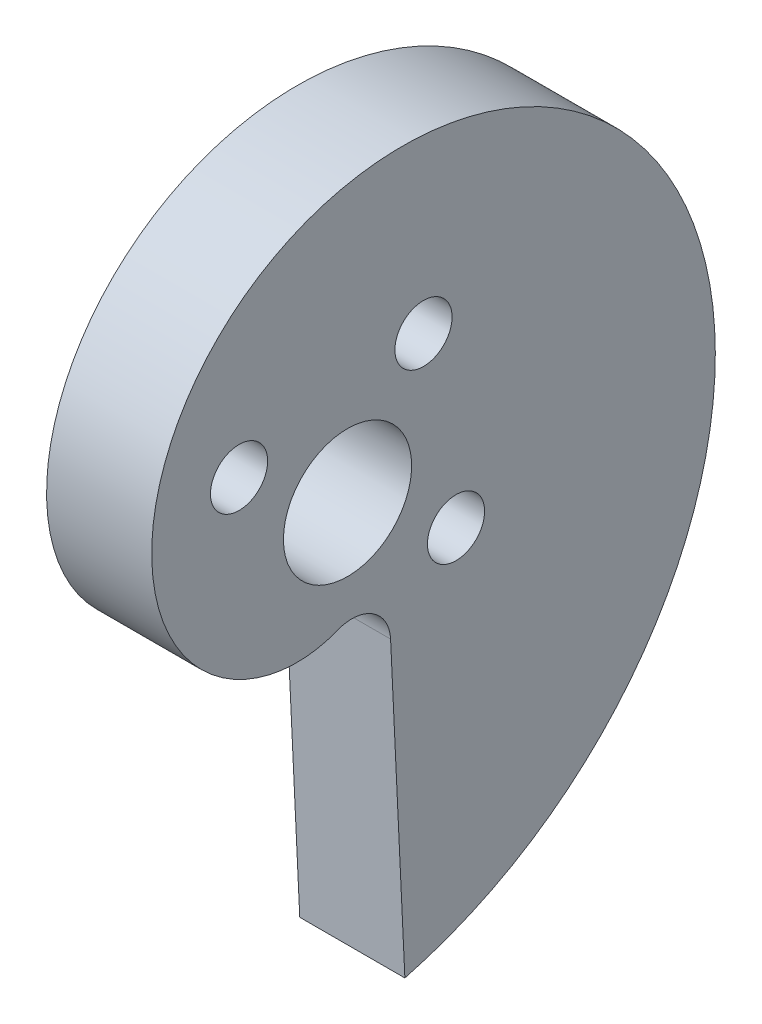
ISO-10303-21;
HEADER;
FILE_DESCRIPTION(('STEP AP214'),'2;1');
FILE_NAME('part.step','',(''),(''),'','','');
FILE_SCHEMA(('AUTOMOTIVE_DESIGN { 1 0 10303 214 1 1 1 1 }'));
ENDSEC;
DATA;
#1=APPLICATION_CONTEXT('core data for automotive mechanical design processes');
#2=APPLICATION_PROTOCOL_DEFINITION('international standard','automotive_design',2000,#1);
#3=PRODUCT_CONTEXT('',#1,'mechanical');
#4=PRODUCT('Part','Part','',(#3));
#5=PRODUCT_RELATED_PRODUCT_CATEGORY('part','',(#4));
#6=PRODUCT_DEFINITION_FORMATION('','',#4);
#7=PRODUCT_DEFINITION_CONTEXT('part definition',#1,'design');
#8=PRODUCT_DEFINITION('design','',#6,#7);
#9=PRODUCT_DEFINITION_SHAPE('','',#8);
#10=(LENGTH_UNIT() NAMED_UNIT(*) SI_UNIT(.MILLI.,.METRE.));
#11=(NAMED_UNIT(*) PLANE_ANGLE_UNIT() SI_UNIT($,.RADIAN.));
#12=(NAMED_UNIT(*) SI_UNIT($,.STERADIAN.) SOLID_ANGLE_UNIT());
#13=UNCERTAINTY_MEASURE_WITH_UNIT(LENGTH_MEASURE(1.E-05),#10,'distance_accuracy_value','');
#14=(GEOMETRIC_REPRESENTATION_CONTEXT(3) GLOBAL_UNCERTAINTY_ASSIGNED_CONTEXT((#13)) GLOBAL_UNIT_ASSIGNED_CONTEXT((#10,
#11,#12)) REPRESENTATION_CONTEXT('',''));
#15=CARTESIAN_POINT('',(0.,0.,0.));
#16=DIRECTION('',(0.,0.,1.));
#17=DIRECTION('',(1.,0.,0.));
#18=AXIS2_PLACEMENT_3D('',#15,#16,#17);
#19=CARTESIAN_POINT('',(6.35,16.3980040897592,0.208936694079273));
#20=DIRECTION('',(1.,0.,0.));
#21=DIRECTION('',(0.,0.,-1.));
#22=AXIS2_PLACEMENT_3D('',#19,#20,#21);
#23=PLANE('',#22);
#24=CARTESIAN_POINT('',(6.35,0.,0.));
#25=DIRECTION('',(-1.,0.,0.));
#26=DIRECTION('',(0.,0.,1.));
#27=AXIS2_PLACEMENT_3D('',#24,#25,#26);
#28=CIRCLE('',#27,3.873);
#29=CARTESIAN_POINT('',(6.35,0.,3.873));
#30=VERTEX_POINT('',#29);
#31=EDGE_CURVE('E138',#30,#30,#28,.T.);
#32=ORIENTED_EDGE('',*,*,#31,.T.);
#33=EDGE_LOOP('',(#32));
#34=FACE_BOUND('',#33,.T.);
#35=CARTESIAN_POINT('',(6.35,4.58861149080839,6.55321635431194));
#36=DIRECTION('',(-1.,0.,0.));
#37=DIRECTION('',(0.,0.,1.));
#38=AXIS2_PLACEMENT_3D('',#35,#36,#37);
#39=CIRCLE('',#38,1.7272);
#40=CARTESIAN_POINT('',(6.35,4.58861149080839,8.28041635431194));
#41=VERTEX_POINT('',#40);
#42=EDGE_CURVE('E142',#41,#41,#39,.T.);
#43=ORIENTED_EDGE('',*,*,#42,.T.);
#44=EDGE_LOOP('',(#43));
#45=FACE_BOUND('',#44,.T.);
#46=CARTESIAN_POINT('',(6.35,6.55321635431194,-4.58861149080837));
#47=DIRECTION('',(-1.,0.,0.));
#48=DIRECTION('',(0.,0.,1.));
#49=AXIS2_PLACEMENT_3D('',#46,#47,#48);
#50=CIRCLE('',#49,1.7272);
#51=CARTESIAN_POINT('',(6.35,6.55321635431194,-2.86141149080837));
#52=VERTEX_POINT('',#51);
#53=EDGE_CURVE('E146',#52,#52,#50,.T.);
#54=ORIENTED_EDGE('',*,*,#53,.T.);
#55=EDGE_LOOP('',(#54));
#56=FACE_BOUND('',#55,.T.);
#57=CARTESIAN_POINT('',(6.35,-4.58861149080837,-6.55321635431192));
#58=DIRECTION('',(-1.,0.,0.));
#59=DIRECTION('',(0.,0.,1.));
#60=AXIS2_PLACEMENT_3D('',#57,#58,#59);
#61=CIRCLE('',#60,1.7272);
#62=CARTESIAN_POINT('',(6.35,-4.58861149080837,-4.82601635431192));
#63=VERTEX_POINT('',#62);
#64=EDGE_CURVE('E87',#63,#63,#61,.T.);
#65=ORIENTED_EDGE('',*,*,#64,.T.);
#66=EDGE_LOOP('',(#65));
#67=FACE_BOUND('',#66,.T.);
#68=CARTESIAN_POINT('',(6.35,-26.6041786448891,-3.46411616806894));
#69=CARTESIAN_POINT('',(6.35,-26.5960990181453,-3.49393067135354));
#70=CARTESIAN_POINT('',(6.35,-26.5880156349324,-3.52374410868873));
#71=CARTESIAN_POINT('',(6.35,-26.5718488325451,-3.58337111594988));
#72=CARTESIAN_POINT('',(6.35,-26.5637654133707,-3.61318468587584));
#73=CARTESIAN_POINT('',(6.35,-26.5395261439436,-3.70262963202641));
#74=CARTESIAN_POINT('',(6.35,-26.5233815637382,-3.76226420628094));
#75=CARTESIAN_POINT('',(6.35,-26.4906236526863,-3.88140637873935));
#76=CARTESIAN_POINT('',(6.35,-26.4740103112024,-3.94091397402874));
#77=CARTESIAN_POINT('',(6.35,-26.4403815894244,-4.05981460436438));
#78=CARTESIAN_POINT('',(6.35,-26.4233662121929,-4.11920764027957));
#79=CARTESIAN_POINT('',(6.35,-26.3716923994657,-4.29720938115184));
#80=CARTESIAN_POINT('',(6.35,-26.3364072843143,-4.41563707917067));
#81=CARTESIAN_POINT('',(6.35,-26.2641853845529,-4.6519850599258));
#82=CARTESIAN_POINT('',(6.35,-26.2272486119225,-4.76990534633561));
#83=CARTESIAN_POINT('',(6.35,-26.1139444068046,-5.12293103285834));
#84=CARTESIAN_POINT('',(6.35,-26.0350986002427,-5.35724781947172));
#85=CARTESIAN_POINT('',(6.35,-25.8708563849999,-5.8235592949556));
#86=CARTESIAN_POINT('',(6.35,-25.7854600420231,-6.05555400709093));
#87=CARTESIAN_POINT('',(6.35,-25.5195003139906,-6.74780898379338));
#88=CARTESIAN_POINT('',(6.35,-25.3291595386374,-7.20436094526831));
#89=CARTESIAN_POINT('',(6.35,-24.9225212871115,-8.10647878886224));
#90=CARTESIAN_POINT('',(6.35,-24.7061887301483,-8.55202882213988));
#91=CARTESIAN_POINT('',(6.35,-24.2482870811777,-9.42992884621023));
#92=CARTESIAN_POINT('',(6.35,-24.0067199993427,-9.86227988488946));
#93=CARTESIAN_POINT('',(6.35,-23.499035484093,-10.7123263424163));
#94=CARTESIAN_POINT('',(6.35,-23.2329186005125,-11.1300220892049));
#95=CARTESIAN_POINT('',(6.35,-22.7456402479494,-11.847851602567));
#96=CARTESIAN_POINT('',(6.35,-22.5296437628228,-12.1515056315926));
#97=CARTESIAN_POINT('',(6.35,-22.084413352748,-12.7489932481006));
#98=CARTESIAN_POINT('',(6.35,-21.8551785466971,-13.0428261798607));
#99=CARTESIAN_POINT('',(6.35,-21.3838895241104,-13.620035602395));
#100=CARTESIAN_POINT('',(6.35,-21.141834989919,-13.9034118337705));
#101=CARTESIAN_POINT('',(6.35,-20.6453436861472,-14.4590921821359));
#102=CARTESIAN_POINT('',(6.35,-20.3909071208197,-14.7313964816312));
#103=CARTESIAN_POINT('',(6.35,-19.870311136869,-15.2640889646824));
#104=CARTESIAN_POINT('',(6.35,-19.6041625900917,-15.5244877601765));
#105=CARTESIAN_POINT('',(6.35,-19.0603866610495,-16.0329689554833));
#106=CARTESIAN_POINT('',(6.35,-18.7827592318886,-16.2810513049693));
#107=CARTESIAN_POINT('',(6.35,-17.933432481453,-17.0059312611249));
#108=CARTESIAN_POINT('',(6.35,-17.3451183982972,-17.4635361757599));
#109=CARTESIAN_POINT('',(6.35,-16.1647015449857,-18.2976613403723));
#110=CARTESIAN_POINT('',(6.35,-15.5748340735074,-18.6773591195821));
#111=CARTESIAN_POINT('',(6.35,-14.3640301688315,-19.3835613476243));
#112=CARTESIAN_POINT('',(6.35,-13.7430946848625,-19.7100674203402));
#113=CARTESIAN_POINT('',(6.35,-12.4747331278291,-20.3069368781326));
#114=CARTESIAN_POINT('',(6.35,-11.8273052792346,-20.5772964928467));
#115=CARTESIAN_POINT('',(6.35,-10.5107649849682,-21.0586719994844));
#116=CARTESIAN_POINT('',(6.35,-9.84165333182641,-21.2696900575841));
#117=CARTESIAN_POINT('',(6.35,-8.51931603069606,-21.6215571855532));
#118=CARTESIAN_POINT('',(6.35,-7.86685786047716,-21.7652761257472));
#119=CARTESIAN_POINT('',(6.35,-6.88075589921008,-21.9374607449297));
#120=CARTESIAN_POINT('',(6.35,-6.55078378350999,-21.9876263623933));
#121=CARTESIAN_POINT('',(6.35,-5.88895381514913,-22.0733163220885));
#122=CARTESIAN_POINT('',(6.35,-5.55709595067515,-22.1088405724972));
#123=CARTESIAN_POINT('',(6.35,-4.55979382082403,-22.1932365925857));
#124=CARTESIAN_POINT('',(6.35,-3.89228024143644,-22.2199912172447));
#125=CARTESIAN_POINT('',(6.35,-2.89152295014816,-22.2149934639596));
#126=CARTESIAN_POINT('',(6.35,-2.55798556615433,-22.2058023918767));
#127=CARTESIAN_POINT('',(6.35,-1.89167446294591,-22.1722723503277));
#128=CARTESIAN_POINT('',(6.35,-1.55890073697784,-22.1479335153446));
#129=CARTESIAN_POINT('',(6.35,-0.595715786563489,-22.0553379817985));
#130=CARTESIAN_POINT('',(6.35,0.0329519082644807,-21.9672696384117));
#131=CARTESIAN_POINT('',(6.35,0.968090394017084,-21.7940847068843));
#132=CARTESIAN_POINT('',(6.35,1.27852595277456,-21.7295000942686));
#133=CARTESIAN_POINT('',(6.35,1.89622303880414,-21.5866153495594));
#134=CARTESIAN_POINT('',(6.35,2.20348455851135,-21.5083151847848));
#135=CARTESIAN_POINT('',(6.35,3.11949232688065,-21.2529876735919));
#136=CARTESIAN_POINT('',(6.35,3.72272393447467,-21.0554848603221));
#137=CARTESIAN_POINT('',(6.35,4.61211008989112,-20.7191477551366));
#138=CARTESIAN_POINT('',(6.35,4.90602590174425,-20.600340041007));
#139=CARTESIAN_POINT('',(6.35,5.48814338740102,-20.3494332944114));
#140=CARTESIAN_POINT('',(6.35,5.77634502116379,-20.2173341688482));
#141=CARTESIAN_POINT('',(6.35,6.60155511822596,-19.8159032003133));
#142=CARTESIAN_POINT('',(6.35,7.13040589307388,-19.5295564938876));
#143=CARTESIAN_POINT('',(6.35,8.16081793802565,-18.9114937344462));
#144=CARTESIAN_POINT('',(6.35,8.66238000700598,-18.5797790105786));
#145=CARTESIAN_POINT('',(6.35,9.63370323518806,-17.8727976579963));
#146=CARTESIAN_POINT('',(6.35,10.1034706650373,-17.4975396568974));
#147=CARTESIAN_POINT('',(6.35,11.0071094740781,-16.7060538785788));
#148=CARTESIAN_POINT('',(6.35,11.4409836517707,-16.2898293009652));
#149=CARTESIAN_POINT('',(6.35,12.2455901724637,-15.4431512610323));
#150=CARTESIAN_POINT('',(6.35,12.6184856964032,-15.0147506322602));
#151=CARTESIAN_POINT('',(6.35,13.3251088370727,-14.1266556784948));
#152=CARTESIAN_POINT('',(6.35,13.658837644674,-13.6669623056353));
#153=CARTESIAN_POINT('',(6.35,14.1273347711691,-12.9565066966575));
#154=CARTESIAN_POINT('',(6.35,14.2781567865579,-12.7161917146737));
#155=CARTESIAN_POINT('',(6.35,14.5687526701808,-12.2289769415579));
#156=CARTESIAN_POINT('',(6.35,14.7085275622432,-11.982077763481));
#157=CARTESIAN_POINT('',(6.35,14.976662087067,-11.4822081934086));
#158=CARTESIAN_POINT('',(6.35,15.1050233906383,-11.2292386969412));
#159=CARTESIAN_POINT('',(6.35,15.3500337253178,-10.7175936099666));
#160=CARTESIAN_POINT('',(6.35,15.4666792251924,-10.4589163275719));
#161=CARTESIAN_POINT('',(6.35,15.6813212851905,-9.95180679999024));
#162=CARTESIAN_POINT('',(6.35,15.7800115945683,-9.70366850500394));
#163=CARTESIAN_POINT('',(6.35,15.9663531695722,-9.2032821883138));
#164=CARTESIAN_POINT('',(6.35,16.0540033918904,-8.95103378073715));
#165=CARTESIAN_POINT('',(6.35,16.3000334282841,-8.18886243094257));
#166=CARTESIAN_POINT('',(6.35,16.4415695943575,-7.67333168162063));
#167=CARTESIAN_POINT('',(6.35,16.6185812659381,-6.89232214687901));
#168=CARTESIAN_POINT('',(6.35,16.6717037530089,-6.63069488211353));
#169=CARTESIAN_POINT('',(6.35,16.7659669980484,-6.10528997868587));
#170=CARTESIAN_POINT('',(6.35,16.8071076371406,-5.84151231871546));
#171=CARTESIAN_POINT('',(6.35,16.9123052056012,-5.04776388346588));
#172=CARTESIAN_POINT('',(6.35,16.9581756794004,-4.5152108565262));
#173=CARTESIAN_POINT('',(6.35,16.9889866131176,-3.73188497077908));
#174=CARTESIAN_POINT('',(6.35,16.9933497523758,-3.48170479371437));
#175=CARTESIAN_POINT('',(6.35,16.9910077767209,-2.98139125909959));
#176=CARTESIAN_POINT('',(6.35,16.9843028337307,-2.73125790088262));
#177=CARTESIAN_POINT('',(6.35,16.9474771512814,-1.98170896838924));
#178=CARTESIAN_POINT('',(6.35,16.9006509706288,-1.48300889884048));
#179=CARTESIAN_POINT('',(6.35,16.7621449217171,-0.492050969980706));
#180=CARTESIAN_POINT('',(6.35,16.6704764254929,0.00020849019213582));
#181=CARTESIAN_POINT('',(6.35,16.4420525322467,0.974178631913562));
#182=CARTESIAN_POINT('',(6.35,16.3052998467292,1.45588994600308));
#183=CARTESIAN_POINT('',(6.35,15.9979016234245,2.37265974437791));
#184=CARTESIAN_POINT('',(6.35,15.8301329655558,2.80868423790338));
#185=CARTESIAN_POINT('',(6.35,15.4562265829443,3.66397859957526));
#186=CARTESIAN_POINT('',(6.35,15.2500901712971,4.08324904051499));
#187=CARTESIAN_POINT('',(6.35,14.8006581322923,4.90125114980656));
#188=CARTESIAN_POINT('',(6.35,14.5573729209783,5.29998853358491));
#189=CARTESIAN_POINT('',(6.35,14.0347805079883,6.07310185409697));
#190=CARTESIAN_POINT('',(6.35,13.7554758700731,6.44747952183559));
#191=CARTESIAN_POINT('',(6.35,13.1839183924489,7.14235925341812));
#192=CARTESIAN_POINT('',(6.35,12.8940275022432,7.46479955466107));
#193=CARTESIAN_POINT('',(6.35,12.4384424571224,7.92791034063023));
#194=CARTESIAN_POINT('',(6.35,12.2831032441109,8.07887213844365));
#195=CARTESIAN_POINT('',(6.35,11.9657286963515,8.37357323403963));
#196=CARTESIAN_POINT('',(6.35,11.8036933306129,8.51731249838838));
#197=CARTESIAN_POINT('',(6.35,11.3080343569058,8.93710093457745));
#198=CARTESIAN_POINT('',(6.35,10.9646916643919,9.20188991072441));
#199=CARTESIAN_POINT('',(6.35,10.4324327389453,9.57404235832414));
#200=CARTESIAN_POINT('',(6.35,10.2521216010789,9.69393119674056));
#201=CARTESIAN_POINT('',(6.35,9.88598424193469,9.92497549292142));
#202=CARTESIAN_POINT('',(6.35,9.70015816748061,10.0361311829009));
#203=CARTESIAN_POINT('',(6.35,9.16444116405589,10.3393060660077));
#204=CARTESIAN_POINT('',(6.35,8.80832915226598,10.5204801836729));
#205=CARTESIAN_POINT('',(6.35,8.08132908197637,10.8501433844362));
#206=CARTESIAN_POINT('',(6.35,7.71044060320731,10.9986315371016));
#207=CARTESIAN_POINT('',(6.35,6.95664104338392,11.2610276657326));
#208=CARTESIAN_POINT('',(6.35,6.57373373578024,11.3749463776861));
#209=CARTESIAN_POINT('',(6.35,5.99273470026,11.5183452851603));
#210=CARTESIAN_POINT('',(6.35,5.7979496332391,11.5615669025186));
#211=CARTESIAN_POINT('',(6.35,5.40652321008225,11.6385618313836));
#212=CARTESIAN_POINT('',(6.35,5.20988190770239,11.6723354156404));
#213=CARTESIAN_POINT('',(6.35,4.65033370171099,11.7544105230111));
#214=CARTESIAN_POINT('',(6.35,4.28568497206795,11.7912985181493));
#215=CARTESIAN_POINT('',(6.35,3.55455013605828,11.8318701835188));
#216=CARTESIAN_POINT('',(6.35,3.18806390085958,11.8355514920303));
#217=CARTESIAN_POINT('',(6.35,2.45641583932739,11.8090174666788));
#218=CARTESIAN_POINT('',(6.35,2.09125359671678,11.778813920978));
#219=CARTESIAN_POINT('',(6.35,1.36548059192559,11.6838082483825));
#220=CARTESIAN_POINT('',(6.35,1.00486887674723,11.6190134931392));
#221=CARTESIAN_POINT('',(6.35,0.324307942849594,11.4614382628748));
#222=CARTESIAN_POINT('',(6.35,0.00364406995611465,11.3717401093354));
#223=CARTESIAN_POINT('',(6.35,-0.628147099321365,11.1632867552544));
#224=CARTESIAN_POINT('',(6.35,-0.939273778376596,11.044529678221));
#225=CARTESIAN_POINT('',(6.35,-1.54892201894779,10.7784921512198));
#226=CARTESIAN_POINT('',(6.35,-1.84744907693349,10.6312242987931));
#227=CARTESIAN_POINT('',(6.35,-2.42897758776261,10.3086185913174));
#228=CARTESIAN_POINT('',(6.35,-2.71198222110295,10.1332865156067));
#229=CARTESIAN_POINT('',(6.35,-3.10837977647508,9.85924255327324));
#230=CARTESIAN_POINT('',(6.35,-3.22942542142978,9.77144787341416));
#231=CARTESIAN_POINT('',(6.35,-3.46732952151261,9.59036048217526));
#232=CARTESIAN_POINT('',(6.35,-3.58418806355643,9.4970678850274));
#233=CARTESIAN_POINT('',(6.35,-3.92806004067557,9.20918027089204));
#234=CARTESIAN_POINT('',(6.35,-4.14842759657389,9.00653556116692));
#235=CARTESIAN_POINT('',(6.35,-4.56878919503829,8.58138333255455));
#236=CARTESIAN_POINT('',(6.35,-4.76879483064123,8.35888725296908));
#237=CARTESIAN_POINT('',(6.35,-5.14614206186432,7.89543066389403));
#238=CARTESIAN_POINT('',(6.35,-5.3234875023102,7.65447329791619));
#239=CARTESIAN_POINT('',(6.35,-5.63430947780914,7.18366218799663));
#240=CARTESIAN_POINT('',(6.35,-5.77047423090025,6.95558248768723));
#241=CARTESIAN_POINT('',(6.35,-6.02062257579595,6.48754083821427));
#242=CARTESIAN_POINT('',(6.35,-6.1346071224693,6.24757940112347));
#243=CARTESIAN_POINT('',(6.35,-6.33887912149973,5.75777155134351));
#244=CARTESIAN_POINT('',(6.35,-6.42916767621237,5.50792559911196));
#245=CARTESIAN_POINT('',(6.35,-6.58443349235139,5.00049357965073));
#246=CARTESIAN_POINT('',(6.35,-6.64941442335705,4.74290864040478));
#247=CARTESIAN_POINT('',(6.35,-6.74598736460804,4.25449797920384));
#248=CARTESIAN_POINT('',(6.35,-6.780711824222,4.02429629283166));
#249=CARTESIAN_POINT('',(6.35,-6.81617319998053,3.67733736076881));
#250=CARTESIAN_POINT('',(6.35,-6.82522288289698,3.56139077828091));
#251=CARTESIAN_POINT('',(6.35,-6.83763420983804,3.32919441165276));
#252=CARTESIAN_POINT('',(6.35,-6.84099580829413,3.21294462509094));
#253=CARTESIAN_POINT('',(6.35,-6.84242850832694,2.86488965539435));
#254=CARTESIAN_POINT('',(6.35,-6.83192934168472,2.6329862272909));
#255=CARTESIAN_POINT('',(6.35,-6.78738287473666,2.17159674221351));
#256=CARTESIAN_POINT('',(6.35,-6.75335040877215,1.94210925480276));
#257=CARTESIAN_POINT('',(6.35,-6.66928060603601,1.52806566622524));
#258=CARTESIAN_POINT('',(6.35,-6.62312313736352,1.34272156396831));
#259=CARTESIAN_POINT('',(6.35,-6.51402688183936,0.977073180265552));
#260=CARTESIAN_POINT('',(6.35,-6.45108967798272,0.796768425181119));
#261=CARTESIAN_POINT('',(6.35,-6.37955418312461,0.619822850888123));
#262=B_SPLINE_CURVE_WITH_KNOTS('',3,(#68,#69,#70,#71,#72,#73,#74,#75,#76,#77,#78,#79,#80,#81,
#82,#83,#84,#85,#86,#87,#88,#89,#90,#91,#92,#93,#94,#95,#96,#97,#98,#99,#100,#101,#102,#103,
#104,#105,#106,#107,#108,#109,#110,#111,#112,#113,#114,#115,#116,#117,#118,#119,#120,#121,#122,
#123,#124,#125,#126,#127,#128,#129,#130,#131,#132,#133,#134,#135,#136,#137,#138,#139,#140,#141,
#142,#143,#144,#145,#146,#147,#148,#149,#150,#151,#152,#153,#154,#155,#156,#157,#158,#159,#160,
#161,#162,#163,#164,#165,#166,#167,#168,#169,#170,#171,#172,#173,#174,#175,#176,#177,#178,#179,
#180,#181,#182,#183,#184,#185,#186,#187,#188,#189,#190,#191,#192,#193,#194,#195,#196,#197,#198,
#199,#200,#201,#202,#203,#204,#205,#206,#207,#208,#209,#210,#211,#212,#213,#214,#215,#216,#217,
#218,#219,#220,#221,#222,#223,#224,#225,#226,#227,#228,#229,#230,#231,#232,#233,#234,#235,#236,
#237,#238,#239,#240,#241,#242,#243,#244,#245,#246,#247,#248,#249,#250,#251,#252,#253,#254,#255,
#256,#257,#258,#259,#260,#261),.UNSPECIFIED.,.F.,.F.,(4,2,2,2,2,2,2,2,2,2,2,2,2,2,2,2,2,2,2,2,2,
2,2,2,2,2,2,2,2,2,2,2,2,2,2,2,2,2,2,2,2,2,2,2,2,2,2,2,2,2,2,2,2,2,2,2,2,2,2,2,2,2,2,2,2,2,2,2,2,
2,2,2,2,2,2,2,2,2,2,2,2,2,2,2,2,2,2,2,2,2,2,2,2,2,2,2,4),(0.,0.0926695617352574,
0.185339535614265,0.370682711215113,0.556030096112552,0.741376069577325,1.1120793414309,
1.48277992497415,2.2243479758606,2.96590858953527,4.44896419863202,5.93404444342148,
7.41900647738353,8.90393526118761,10.0215131922545,11.1391655918504,12.2568456983469,
13.3745073739483,14.4911525872986,15.6078023630403,17.8403733209062,19.942329574827,
22.0442216463401,24.1462548190774,26.2482112502258,28.2497809593054,29.2507798930136,
30.2517851043673,32.2527611602103,33.2534722057809,34.2541743670945,36.1557427204534,
37.1067331856918,38.0577259169634,39.9589143278495,40.9097121227251,41.8605165777567,
43.6622308050559,45.4638922587852,47.265197340965,49.0663618475696,50.7681276305578,
52.4698416576219,53.3207700719231,54.1716195309475,55.0223442302499,55.8733245798795,
56.6741831513156,57.475117348612,59.0763957503357,59.8770662248953,60.6777446429507,
62.2785901719909,63.0290553534382,63.7795088778617,65.2800101467939,66.7801310849274,
68.2801618175425,69.6799153349475,71.0796209560827,72.4789348360549,73.8781491717417,
75.1771008636637,75.8267289281718,76.4763599995956,77.7749132133461,78.4243090869169,
79.0736876871546,80.2706163235864,81.4675790271636,82.6641696171176,83.2625396804237,
83.860892467929,84.9588208120137,86.0568272421415,87.154451806521,88.2518425520269,
89.2493967940745,90.2470154706009,91.2441943493013,92.24116813994,92.6896317930356,
93.1380861315428,94.0347850469901,94.9309705386994,95.8270037693383,96.622784174215,
97.418530312772,98.2142394260493,99.009833119334,99.7071699333863,100.055943118078,
100.404719096858,101.099890942744,101.794624982317,102.366866921723,102.939054895092),.UNSPECIFIED.);
#263=CARTESIAN_POINT('',(6.35,-26.6041786448891,-3.46411616806894));
#264=VERTEX_POINT('',#263);
#265=CARTESIAN_POINT('',(6.35,-6.37955418312461,0.619822850888123));
#266=VERTEX_POINT('',#265);
#267=EDGE_CURVE('E118',#264,#266,#262,.T.);
#268=ORIENTED_EDGE('',*,*,#267,.T.);
#269=CARTESIAN_POINT('',(6.35,-8.55278837318837,-0.259188983321581));
#270=DIRECTION('',(1.,0.,0.));
#271=DIRECTION('',(0.,0.,-1.));
#272=AXIS2_PLACEMENT_3D('',#269,#270,#271);
#273=CIRCLE('',#272,2.34427145389411);
#274=CARTESIAN_POINT('',(6.35,-8.44148736532646,-2.60081677936256));
#275=VERTEX_POINT('',#274);
#276=EDGE_CURVE('E41',#266,#275,#273,.F.);
#277=ORIENTED_EDGE('',*,*,#276,.T.);
#278=DIRECTION('',(0.,-0.998872290216758,-0.0474778668131734));
#279=VECTOR('',#278,1.);
#280=CARTESIAN_POINT('',(6.35,-26.3357339713737,-3.45135659852166));
#281=LINE('',#280,#279);
#282=EDGE_CURVE('E55',#275,#264,#281,.T.);
#283=ORIENTED_EDGE('',*,*,#282,.T.);
#284=EDGE_LOOP('',(#268,#277,#283));
#285=FACE_BOUND('',#284,.T.);
#286=ADVANCED_FACE('F37',(#34,#45,#56,#67,#285),#23,.T.);
#287=CARTESIAN_POINT('',(0.,16.3980040897592,0.208936694079273));
#288=DIRECTION('',(1.,0.,0.));
#289=DIRECTION('',(0.,0.,-1.));
#290=AXIS2_PLACEMENT_3D('',#287,#288,#289);
#291=PLANE('',#290);
#292=CARTESIAN_POINT('',(0.,0.,0.));
#293=DIRECTION('',(-1.,0.,0.));
#294=DIRECTION('',(0.,0.,1.));
#295=AXIS2_PLACEMENT_3D('',#292,#293,#294);
#296=CIRCLE('',#295,3.873);
#297=CARTESIAN_POINT('',(0.,0.,3.873));
#298=VERTEX_POINT('',#297);
#299=EDGE_CURVE('E157',#298,#298,#296,.T.);
#300=ORIENTED_EDGE('',*,*,#299,.F.);
#301=EDGE_LOOP('',(#300));
#302=FACE_BOUND('',#301,.T.);
#303=CARTESIAN_POINT('',(0.,4.58861149080839,6.55321635431194));
#304=DIRECTION('',(-1.,0.,0.));
#305=DIRECTION('',(0.,0.,1.));
#306=AXIS2_PLACEMENT_3D('',#303,#304,#305);
#307=CIRCLE('',#306,1.7272);
#308=CARTESIAN_POINT('',(0.,4.58861149080839,8.28041635431194));
#309=VERTEX_POINT('',#308);
#310=EDGE_CURVE('E161',#309,#309,#307,.T.);
#311=ORIENTED_EDGE('',*,*,#310,.F.);
#312=EDGE_LOOP('',(#311));
#313=FACE_BOUND('',#312,.T.);
#314=CARTESIAN_POINT('',(0.,6.55321635431194,-4.58861149080837));
#315=DIRECTION('',(-1.,0.,0.));
#316=DIRECTION('',(0.,0.,1.));
#317=AXIS2_PLACEMENT_3D('',#314,#315,#316);
#318=CIRCLE('',#317,1.7272);
#319=CARTESIAN_POINT('',(0.,6.55321635431194,-2.86141149080837));
#320=VERTEX_POINT('',#319);
#321=EDGE_CURVE('E152',#320,#320,#318,.T.);
#322=ORIENTED_EDGE('',*,*,#321,.F.);
#323=EDGE_LOOP('',(#322));
#324=FACE_BOUND('',#323,.T.);
#325=CARTESIAN_POINT('',(0.,-4.58861149080837,-6.55321635431192));
#326=DIRECTION('',(-1.,0.,0.));
#327=DIRECTION('',(0.,0.,1.));
#328=AXIS2_PLACEMENT_3D('',#325,#326,#327);
#329=CIRCLE('',#328,1.7272);
#330=CARTESIAN_POINT('',(0.,-4.58861149080837,-4.82601635431192));
#331=VERTEX_POINT('',#330);
#332=EDGE_CURVE('E90',#331,#331,#329,.T.);
#333=ORIENTED_EDGE('',*,*,#332,.F.);
#334=EDGE_LOOP('',(#333));
#335=FACE_BOUND('',#334,.T.);
#336=CARTESIAN_POINT('',(0.,-26.6041786448891,-3.46411616806894));
#337=CARTESIAN_POINT('',(0.,-26.5960990181453,-3.49393067135354));
#338=CARTESIAN_POINT('',(0.,-26.5880156349324,-3.52374410868873));
#339=CARTESIAN_POINT('',(0.,-26.5718488325451,-3.58337111594988));
#340=CARTESIAN_POINT('',(0.,-26.5637654133707,-3.61318468587584));
#341=CARTESIAN_POINT('',(0.,-26.5395261439436,-3.70262963202641));
#342=CARTESIAN_POINT('',(0.,-26.5233815637382,-3.76226420628094));
#343=CARTESIAN_POINT('',(0.,-26.4906236526863,-3.88140637873935));
#344=CARTESIAN_POINT('',(0.,-26.4740103112024,-3.94091397402874));
#345=CARTESIAN_POINT('',(0.,-26.4403815894244,-4.05981460436438));
#346=CARTESIAN_POINT('',(0.,-26.4233662121929,-4.11920764027957));
#347=CARTESIAN_POINT('',(0.,-26.3716923994657,-4.29720938115184));
#348=CARTESIAN_POINT('',(0.,-26.3364072843143,-4.41563707917067));
#349=CARTESIAN_POINT('',(0.,-26.2641853845529,-4.6519850599258));
#350=CARTESIAN_POINT('',(0.,-26.2272486119225,-4.76990534633561));
#351=CARTESIAN_POINT('',(0.,-26.1139444068046,-5.12293103285834));
#352=CARTESIAN_POINT('',(0.,-26.0350986002427,-5.35724781947172));
#353=CARTESIAN_POINT('',(0.,-25.8708563849999,-5.8235592949556));
#354=CARTESIAN_POINT('',(0.,-25.7854600420231,-6.05555400709093));
#355=CARTESIAN_POINT('',(0.,-25.5195003139906,-6.74780898379338));
#356=CARTESIAN_POINT('',(0.,-25.3291595386374,-7.20436094526831));
#357=CARTESIAN_POINT('',(0.,-24.9225212871115,-8.10647878886224));
#358=CARTESIAN_POINT('',(0.,-24.7061887301483,-8.55202882213988));
#359=CARTESIAN_POINT('',(0.,-24.2482870811777,-9.42992884621023));
#360=CARTESIAN_POINT('',(0.,-24.0067199993427,-9.86227988488946));
#361=CARTESIAN_POINT('',(0.,-23.499035484093,-10.7123263424163));
#362=CARTESIAN_POINT('',(0.,-23.2329186005125,-11.1300220892049));
#363=CARTESIAN_POINT('',(0.,-22.7456402479494,-11.847851602567));
#364=CARTESIAN_POINT('',(0.,-22.5296437628228,-12.1515056315926));
#365=CARTESIAN_POINT('',(0.,-22.084413352748,-12.7489932481006));
#366=CARTESIAN_POINT('',(0.,-21.8551785466971,-13.0428261798607));
#367=CARTESIAN_POINT('',(0.,-21.3838895241104,-13.620035602395));
#368=CARTESIAN_POINT('',(0.,-21.141834989919,-13.9034118337705));
#369=CARTESIAN_POINT('',(0.,-20.6453436861472,-14.4590921821359));
#370=CARTESIAN_POINT('',(0.,-20.3909071208197,-14.7313964816312));
#371=CARTESIAN_POINT('',(0.,-19.870311136869,-15.2640889646824));
#372=CARTESIAN_POINT('',(0.,-19.6041625900917,-15.5244877601765));
#373=CARTESIAN_POINT('',(0.,-19.0603866610495,-16.0329689554833));
#374=CARTESIAN_POINT('',(0.,-18.7827592318886,-16.2810513049693));
#375=CARTESIAN_POINT('',(0.,-17.933432481453,-17.0059312611249));
#376=CARTESIAN_POINT('',(0.,-17.3451183982972,-17.4635361757599));
#377=CARTESIAN_POINT('',(0.,-16.1647015449857,-18.2976613403723));
#378=CARTESIAN_POINT('',(0.,-15.5748340735074,-18.6773591195821));
#379=CARTESIAN_POINT('',(0.,-14.3640301688315,-19.3835613476243));
#380=CARTESIAN_POINT('',(0.,-13.7430946848625,-19.7100674203402));
#381=CARTESIAN_POINT('',(0.,-12.4747331278291,-20.3069368781326));
#382=CARTESIAN_POINT('',(0.,-11.8273052792346,-20.5772964928467));
#383=CARTESIAN_POINT('',(0.,-10.5107649849682,-21.0586719994844));
#384=CARTESIAN_POINT('',(0.,-9.84165333182641,-21.2696900575841));
#385=CARTESIAN_POINT('',(0.,-8.51931603069606,-21.6215571855532));
#386=CARTESIAN_POINT('',(0.,-7.86685786047716,-21.7652761257472));
#387=CARTESIAN_POINT('',(0.,-6.88075589921008,-21.9374607449297));
#388=CARTESIAN_POINT('',(0.,-6.55078378350999,-21.9876263623933));
#389=CARTESIAN_POINT('',(0.,-5.88895381514913,-22.0733163220885));
#390=CARTESIAN_POINT('',(0.,-5.55709595067515,-22.1088405724972));
#391=CARTESIAN_POINT('',(0.,-4.55979382082403,-22.1932365925857));
#392=CARTESIAN_POINT('',(0.,-3.89228024143644,-22.2199912172447));
#393=CARTESIAN_POINT('',(0.,-2.89152295014816,-22.2149934639596));
#394=CARTESIAN_POINT('',(0.,-2.55798556615433,-22.2058023918767));
#395=CARTESIAN_POINT('',(0.,-1.89167446294591,-22.1722723503277));
#396=CARTESIAN_POINT('',(0.,-1.55890073697784,-22.1479335153446));
#397=CARTESIAN_POINT('',(0.,-0.595715786563489,-22.0553379817985));
#398=CARTESIAN_POINT('',(0.,0.0329519082644807,-21.9672696384117));
#399=CARTESIAN_POINT('',(0.,0.968090394017084,-21.7940847068843));
#400=CARTESIAN_POINT('',(0.,1.27852595277456,-21.7295000942686));
#401=CARTESIAN_POINT('',(0.,1.89622303880414,-21.5866153495594));
#402=CARTESIAN_POINT('',(0.,2.20348455851135,-21.5083151847848));
#403=CARTESIAN_POINT('',(0.,3.11949232688065,-21.2529876735919));
#404=CARTESIAN_POINT('',(0.,3.72272393447467,-21.0554848603221));
#405=CARTESIAN_POINT('',(0.,4.61211008989112,-20.7191477551366));
#406=CARTESIAN_POINT('',(0.,4.90602590174425,-20.600340041007));
#407=CARTESIAN_POINT('',(0.,5.48814338740102,-20.3494332944114));
#408=CARTESIAN_POINT('',(0.,5.77634502116379,-20.2173341688482));
#409=CARTESIAN_POINT('',(0.,6.60155511822596,-19.8159032003133));
#410=CARTESIAN_POINT('',(0.,7.13040589307388,-19.5295564938876));
#411=CARTESIAN_POINT('',(0.,8.16081793802565,-18.9114937344462));
#412=CARTESIAN_POINT('',(0.,8.66238000700598,-18.5797790105786));
#413=CARTESIAN_POINT('',(0.,9.63370323518806,-17.8727976579963));
#414=CARTESIAN_POINT('',(0.,10.1034706650373,-17.4975396568974));
#415=CARTESIAN_POINT('',(0.,11.0071094740781,-16.7060538785788));
#416=CARTESIAN_POINT('',(0.,11.4409836517707,-16.2898293009652));
#417=CARTESIAN_POINT('',(0.,12.2455901724637,-15.4431512610323));
#418=CARTESIAN_POINT('',(0.,12.6184856964032,-15.0147506322602));
#419=CARTESIAN_POINT('',(0.,13.3251088370727,-14.1266556784948));
#420=CARTESIAN_POINT('',(0.,13.658837644674,-13.6669623056353));
#421=CARTESIAN_POINT('',(0.,14.1273347711691,-12.9565066966575));
#422=CARTESIAN_POINT('',(0.,14.2781567865579,-12.7161917146737));
#423=CARTESIAN_POINT('',(0.,14.5687526701808,-12.2289769415579));
#424=CARTESIAN_POINT('',(0.,14.7085275622432,-11.982077763481));
#425=CARTESIAN_POINT('',(0.,14.976662087067,-11.4822081934086));
#426=CARTESIAN_POINT('',(0.,15.1050233906383,-11.2292386969412));
#427=CARTESIAN_POINT('',(0.,15.3500337253178,-10.7175936099666));
#428=CARTESIAN_POINT('',(0.,15.4666792251924,-10.4589163275719));
#429=CARTESIAN_POINT('',(0.,15.6813212851905,-9.95180679999024));
#430=CARTESIAN_POINT('',(0.,15.7800115945683,-9.70366850500394));
#431=CARTESIAN_POINT('',(0.,15.9663531695722,-9.2032821883138));
#432=CARTESIAN_POINT('',(0.,16.0540033918904,-8.95103378073715));
#433=CARTESIAN_POINT('',(0.,16.3000334282841,-8.18886243094257));
#434=CARTESIAN_POINT('',(0.,16.4415695943575,-7.67333168162063));
#435=CARTESIAN_POINT('',(0.,16.6185812659381,-6.89232214687901));
#436=CARTESIAN_POINT('',(0.,16.6717037530089,-6.63069488211353));
#437=CARTESIAN_POINT('',(0.,16.7659669980484,-6.10528997868587));
#438=CARTESIAN_POINT('',(0.,16.8071076371406,-5.84151231871546));
#439=CARTESIAN_POINT('',(0.,16.9123052056012,-5.04776388346588));
#440=CARTESIAN_POINT('',(0.,16.9581756794004,-4.5152108565262));
#441=CARTESIAN_POINT('',(0.,16.9889866131176,-3.73188497077908));
#442=CARTESIAN_POINT('',(0.,16.9933497523758,-3.48170479371437));
#443=CARTESIAN_POINT('',(0.,16.9910077767209,-2.98139125909959));
#444=CARTESIAN_POINT('',(0.,16.9843028337307,-2.73125790088262));
#445=CARTESIAN_POINT('',(0.,16.9474771512814,-1.98170896838924));
#446=CARTESIAN_POINT('',(0.,16.9006509706288,-1.48300889884048));
#447=CARTESIAN_POINT('',(0.,16.7621449217171,-0.492050969980706));
#448=CARTESIAN_POINT('',(0.,16.6704764254929,0.00020849019213582));
#449=CARTESIAN_POINT('',(0.,16.4420525322467,0.974178631913562));
#450=CARTESIAN_POINT('',(0.,16.3052998467292,1.45588994600308));
#451=CARTESIAN_POINT('',(0.,15.9979016234245,2.37265974437791));
#452=CARTESIAN_POINT('',(0.,15.8301329655558,2.80868423790338));
#453=CARTESIAN_POINT('',(0.,15.4562265829443,3.66397859957526));
#454=CARTESIAN_POINT('',(0.,15.2500901712971,4.08324904051499));
#455=CARTESIAN_POINT('',(0.,14.8006581322923,4.90125114980656));
#456=CARTESIAN_POINT('',(0.,14.5573729209783,5.29998853358491));
#457=CARTESIAN_POINT('',(0.,14.0347805079883,6.07310185409697));
#458=CARTESIAN_POINT('',(0.,13.7554758700731,6.44747952183559));
#459=CARTESIAN_POINT('',(0.,13.1839183924489,7.14235925341812));
#460=CARTESIAN_POINT('',(0.,12.8940275022432,7.46479955466107));
#461=CARTESIAN_POINT('',(0.,12.4384424571224,7.92791034063023));
#462=CARTESIAN_POINT('',(0.,12.2831032441109,8.07887213844365));
#463=CARTESIAN_POINT('',(0.,11.9657286963515,8.37357323403963));
#464=CARTESIAN_POINT('',(0.,11.8036933306129,8.51731249838838));
#465=CARTESIAN_POINT('',(0.,11.3080343569058,8.93710093457745));
#466=CARTESIAN_POINT('',(0.,10.9646916643919,9.20188991072441));
#467=CARTESIAN_POINT('',(0.,10.4324327389453,9.57404235832414));
#468=CARTESIAN_POINT('',(0.,10.2521216010789,9.69393119674056));
#469=CARTESIAN_POINT('',(0.,9.88598424193469,9.92497549292142));
#470=CARTESIAN_POINT('',(0.,9.70015816748061,10.0361311829009));
#471=CARTESIAN_POINT('',(0.,9.16444116405589,10.3393060660077));
#472=CARTESIAN_POINT('',(0.,8.80832915226598,10.5204801836729));
#473=CARTESIAN_POINT('',(0.,8.08132908197637,10.8501433844362));
#474=CARTESIAN_POINT('',(0.,7.71044060320731,10.9986315371016));
#475=CARTESIAN_POINT('',(0.,6.95664104338392,11.2610276657326));
#476=CARTESIAN_POINT('',(0.,6.57373373578024,11.3749463776861));
#477=CARTESIAN_POINT('',(0.,5.99273470026,11.5183452851603));
#478=CARTESIAN_POINT('',(0.,5.7979496332391,11.5615669025186));
#479=CARTESIAN_POINT('',(0.,5.40652321008225,11.6385618313836));
#480=CARTESIAN_POINT('',(0.,5.20988190770239,11.6723354156404));
#481=CARTESIAN_POINT('',(0.,4.65033370171099,11.7544105230111));
#482=CARTESIAN_POINT('',(0.,4.28568497206795,11.7912985181493));
#483=CARTESIAN_POINT('',(0.,3.55455013605828,11.8318701835188));
#484=CARTESIAN_POINT('',(0.,3.18806390085958,11.8355514920303));
#485=CARTESIAN_POINT('',(0.,2.45641583932739,11.8090174666788));
#486=CARTESIAN_POINT('',(0.,2.09125359671678,11.778813920978));
#487=CARTESIAN_POINT('',(0.,1.36548059192559,11.6838082483825));
#488=CARTESIAN_POINT('',(0.,1.00486887674723,11.6190134931392));
#489=CARTESIAN_POINT('',(0.,0.324307942849594,11.4614382628748));
#490=CARTESIAN_POINT('',(0.,0.00364406995611465,11.3717401093354));
#491=CARTESIAN_POINT('',(0.,-0.628147099321365,11.1632867552544));
#492=CARTESIAN_POINT('',(0.,-0.939273778376596,11.044529678221));
#493=CARTESIAN_POINT('',(0.,-1.54892201894779,10.7784921512198));
#494=CARTESIAN_POINT('',(0.,-1.84744907693349,10.6312242987931));
#495=CARTESIAN_POINT('',(0.,-2.42897758776261,10.3086185913174));
#496=CARTESIAN_POINT('',(0.,-2.71198222110295,10.1332865156067));
#497=CARTESIAN_POINT('',(0.,-3.10837977647508,9.85924255327324));
#498=CARTESIAN_POINT('',(0.,-3.22942542142978,9.77144787341416));
#499=CARTESIAN_POINT('',(0.,-3.46732952151261,9.59036048217526));
#500=CARTESIAN_POINT('',(0.,-3.58418806355643,9.4970678850274));
#501=CARTESIAN_POINT('',(0.,-3.92806004067557,9.20918027089204));
#502=CARTESIAN_POINT('',(0.,-4.14842759657389,9.00653556116692));
#503=CARTESIAN_POINT('',(0.,-4.56878919503829,8.58138333255455));
#504=CARTESIAN_POINT('',(0.,-4.76879483064123,8.35888725296908));
#505=CARTESIAN_POINT('',(0.,-5.14614206186432,7.89543066389403));
#506=CARTESIAN_POINT('',(0.,-5.3234875023102,7.65447329791619));
#507=CARTESIAN_POINT('',(0.,-5.63430947780914,7.18366218799663));
#508=CARTESIAN_POINT('',(0.,-5.77047423090025,6.95558248768723));
#509=CARTESIAN_POINT('',(0.,-6.02062257579595,6.48754083821427));
#510=CARTESIAN_POINT('',(0.,-6.1346071224693,6.24757940112347));
#511=CARTESIAN_POINT('',(0.,-6.33887912149973,5.75777155134351));
#512=CARTESIAN_POINT('',(0.,-6.42916767621237,5.50792559911196));
#513=CARTESIAN_POINT('',(0.,-6.58443349235139,5.00049357965073));
#514=CARTESIAN_POINT('',(0.,-6.64941442335705,4.74290864040478));
#515=CARTESIAN_POINT('',(0.,-6.74598736460804,4.25449797920384));
#516=CARTESIAN_POINT('',(0.,-6.780711824222,4.02429629283166));
#517=CARTESIAN_POINT('',(0.,-6.81617319998053,3.67733736076881));
#518=CARTESIAN_POINT('',(0.,-6.82522288289698,3.56139077828091));
#519=CARTESIAN_POINT('',(0.,-6.83763420983804,3.32919441165276));
#520=CARTESIAN_POINT('',(0.,-6.84099580829413,3.21294462509094));
#521=CARTESIAN_POINT('',(0.,-6.84242850832694,2.86488965539435));
#522=CARTESIAN_POINT('',(0.,-6.83192934168472,2.6329862272909));
#523=CARTESIAN_POINT('',(0.,-6.78738287473666,2.17159674221351));
#524=CARTESIAN_POINT('',(0.,-6.75335040877215,1.94210925480276));
#525=CARTESIAN_POINT('',(0.,-6.66928060603601,1.52806566622524));
#526=CARTESIAN_POINT('',(0.,-6.62312313736352,1.34272156396831));
#527=CARTESIAN_POINT('',(0.,-6.51402688183936,0.977073180265552));
#528=CARTESIAN_POINT('',(0.,-6.45108967798272,0.796768425181119));
#529=CARTESIAN_POINT('',(0.,-6.37955418312461,0.619822850888123));
#530=B_SPLINE_CURVE_WITH_KNOTS('',3,(#336,#337,#338,#339,#340,#341,#342,#343,#344,#345,#346,
#347,#348,#349,#350,#351,#352,#353,#354,#355,#356,#357,#358,#359,#360,#361,#362,#363,#364,#365,
#366,#367,#368,#369,#370,#371,#372,#373,#374,#375,#376,#377,#378,#379,#380,#381,#382,#383,#384,
#385,#386,#387,#388,#389,#390,#391,#392,#393,#394,#395,#396,#397,#398,#399,#400,#401,#402,#403,
#404,#405,#406,#407,#408,#409,#410,#411,#412,#413,#414,#415,#416,#417,#418,#419,#420,#421,#422,
#423,#424,#425,#426,#427,#428,#429,#430,#431,#432,#433,#434,#435,#436,#437,#438,#439,#440,#441,
#442,#443,#444,#445,#446,#447,#448,#449,#450,#451,#452,#453,#454,#455,#456,#457,#458,#459,#460,
#461,#462,#463,#464,#465,#466,#467,#468,#469,#470,#471,#472,#473,#474,#475,#476,#477,#478,#479,
#480,#481,#482,#483,#484,#485,#486,#487,#488,#489,#490,#491,#492,#493,#494,#495,#496,#497,#498,
#499,#500,#501,#502,#503,#504,#505,#506,#507,#508,#509,#510,#511,#512,#513,#514,#515,#516,#517,
#518,#519,#520,#521,#522,#523,#524,#525,#526,#527,#528,#529),.UNSPECIFIED.,.F.,.F.,(4,2,2,2,2,2,
2,2,2,2,2,2,2,2,2,2,2,2,2,2,2,2,2,2,2,2,2,2,2,2,2,2,2,2,2,2,2,2,2,2,2,2,2,2,2,2,2,2,2,2,2,2,2,2,
2,2,2,2,2,2,2,2,2,2,2,2,2,2,2,2,2,2,2,2,2,2,2,2,2,2,2,2,2,2,2,2,2,2,2,2,2,2,2,2,2,2,4),(0.,
0.0926695617352574,0.185339535614265,0.370682711215113,0.556030096112552,0.741376069577325,
1.1120793414309,1.48277992497415,2.2243479758606,2.96590858953527,4.44896419863202,
5.93404444342148,7.41900647738353,8.90393526118761,10.0215131922545,11.1391655918504,
12.2568456983469,13.3745073739483,14.4911525872986,15.6078023630403,17.8403733209062,
19.942329574827,22.0442216463401,24.1462548190774,26.2482112502258,28.2497809593054,
29.2507798930136,30.2517851043673,32.2527611602103,33.2534722057809,34.2541743670945,
36.1557427204534,37.1067331856918,38.0577259169634,39.9589143278495,40.9097121227251,
41.8605165777567,43.6622308050559,45.4638922587852,47.265197340965,49.0663618475696,
50.7681276305578,52.4698416576219,53.3207700719231,54.1716195309475,55.0223442302499,
55.8733245798795,56.6741831513156,57.475117348612,59.0763957503357,59.8770662248953,
60.6777446429507,62.2785901719909,63.0290553534382,63.7795088778617,65.2800101467939,
66.7801310849274,68.2801618175425,69.6799153349475,71.0796209560827,72.4789348360549,
73.8781491717417,75.1771008636637,75.8267289281718,76.4763599995956,77.7749132133461,
78.4243090869169,79.0736876871546,80.2706163235864,81.4675790271636,82.6641696171176,
83.2625396804237,83.860892467929,84.9588208120137,86.0568272421415,87.154451806521,
88.2518425520269,89.2493967940745,90.2470154706009,91.2441943493013,92.24116813994,
92.6896317930356,93.1380861315428,94.0347850469901,94.9309705386994,95.8270037693383,
96.622784174215,97.418530312772,98.2142394260493,99.009833119334,99.7071699333863,
100.055943118078,100.404719096858,101.099890942744,101.794624982317,102.366866921723,
102.939054895092),.UNSPECIFIED.);
#531=CARTESIAN_POINT('',(0.,-26.6041786448891,-3.46411616806894));
#532=VERTEX_POINT('',#531);
#533=CARTESIAN_POINT('',(0.,-6.37955418312461,0.619822850888123));
#534=VERTEX_POINT('',#533);
#535=EDGE_CURVE('E80',#532,#534,#530,.T.);
#536=ORIENTED_EDGE('',*,*,#535,.F.);
#537=DIRECTION('',(0.,-0.998872290216758,-0.0474778668131734));
#538=VECTOR('',#537,1.);
#539=CARTESIAN_POINT('',(0.,-26.3357339713737,-3.45135659852166));
#540=LINE('',#539,#538);
#541=CARTESIAN_POINT('',(0.,-8.44148736532646,-2.60081677936256));
#542=VERTEX_POINT('',#541);
#543=EDGE_CURVE('E69',#542,#532,#540,.T.);
#544=ORIENTED_EDGE('',*,*,#543,.F.);
#545=CARTESIAN_POINT('',(0.,-8.55278837318837,-0.259188983321581));
#546=DIRECTION('',(1.,0.,0.));
#547=DIRECTION('',(0.,0.,-1.));
#548=AXIS2_PLACEMENT_3D('',#545,#546,#547);
#549=CIRCLE('',#548,2.34427145389411);
#550=EDGE_CURVE('E75',#534,#542,#549,.F.);
#551=ORIENTED_EDGE('',*,*,#550,.F.);
#552=EDGE_LOOP('',(#536,#544,#551));
#553=FACE_BOUND('',#552,.T.);
#554=ADVANCED_FACE('F78',(#302,#313,#324,#335,#553),#291,.F.);
#555=CARTESIAN_POINT('',(6.35,-26.7483319063098,-2.10718755279176));
#556=CARTESIAN_POINT('',(6.35,-26.6073824375161,-2.62712941052099));
#557=CARTESIAN_POINT('',(6.35,-26.4664329687224,-3.14707126825022));
#558=CARTESIAN_POINT('',(6.35,-25.8850164099486,-5.29183143138332));
#559=CARTESIAN_POINT('',(6.35,-25.2937709802203,-6.85500985861185));
#560=CARTESIAN_POINT('',(6.35,-23.8451939849136,-9.80629411018198));
#561=CARTESIAN_POINT('',(6.35,-22.9879265697091,-11.1943493778112));
#562=CARTESIAN_POINT('',(6.35,-21.0514010056648,-13.7523524342122));
#563=CARTESIAN_POINT('',(6.35,-19.9722145165317,-14.9222640436458));
#564=CARTESIAN_POINT('',(6.35,-17.6424148443339,-17.0111362692066));
#565=CARTESIAN_POINT('',(6.35,-16.3918777440894,-17.9300760548234));
#566=CARTESIAN_POINT('',(6.35,-13.774181132005,-19.4952108297215));
#567=CARTESIAN_POINT('',(6.35,-12.4070989510175,-20.1414006679111));
#568=CARTESIAN_POINT('',(6.35,-9.61304301680638,-21.1506818581234));
#569=CARTESIAN_POINT('',(6.35,-8.18614470800054,-21.5137834309209));
#570=CARTESIAN_POINT('',(6.35,-5.3288100875924,-21.9578966574969));
#571=CARTESIAN_POINT('',(6.35,-3.8984443651538,-22.038932986476));
#572=CARTESIAN_POINT('',(6.35,-1.08794928189315,-21.9307589450492));
#573=CARTESIAN_POINT('',(6.35,0.292117032528461,-21.7415862291151));
#574=CARTESIAN_POINT('',(6.35,2.95283289615589,-21.1147307327981));
#575=CARTESIAN_POINT('',(6.35,4.23342924609723,-20.6770966268396));
#576=CARTESIAN_POINT('',(6.35,6.65237105198453,-19.5836453555955));
#577=CARTESIAN_POINT('',(6.35,7.79067499289227,-18.9278855327687));
#578=CARTESIAN_POINT('',(6.35,9.88997156551444,-17.4355003933537));
#579=CARTESIAN_POINT('',(6.35,10.8509356728284,-16.5989384482919));
#580=CARTESIAN_POINT('',(6.35,12.5693210600784,-14.7874359048066));
#581=CARTESIAN_POINT('',(6.35,13.3267275415238,-13.8125618959728));
#582=CARTESIAN_POINT('',(6.35,14.6212472227952,-11.7701307863269));
#583=CARTESIAN_POINT('',(6.35,15.1583594978757,-10.7026406297588));
#584=CARTESIAN_POINT('',(6.35,16.0052572395325,-8.52186727257846));
#585=CARTESIAN_POINT('',(6.35,16.3150552236039,-7.40864857435838));
#586=CARTESIAN_POINT('',(6.35,16.7098316537026,-5.1825201174866));
#587=CARTESIAN_POINT('',(6.35,16.7948350803545,-4.06966980389498));
#588=CARTESIAN_POINT('',(6.35,16.7515036458065,-1.88772278855217));
#589=CARTESIAN_POINT('',(6.35,16.6232047553048,-0.818678144435623));
#590=CARTESIAN_POINT('',(6.35,16.1728034242135,1.23655153259428));
#591=CARTESIAN_POINT('',(6.35,15.8507460504129,2.22269384951727));
#592=CARTESIAN_POINT('',(6.35,15.0391926205608,4.07878041726697));
#593=CARTESIAN_POINT('',(6.35,14.5497485015278,4.94869279896394));
#594=CARTESIAN_POINT('',(6.35,13.4351525169527,6.5458728071125));
#595=CARTESIAN_POINT('',(6.35,12.8100570020662,7.27312041446994));
#596=CARTESIAN_POINT('',(6.35,11.4596211058448,8.56619770795014));
#597=CARTESIAN_POINT('',(6.35,10.7343389103516,9.13201969506656));
#598=CARTESIAN_POINT('',(6.35,8.46432492032774,10.5713349527582));
#599=CARTESIAN_POINT('',(6.35,6.82631034463374,11.1827796887629));
#600=CARTESIAN_POINT('',(6.35,3.59680348317033,11.7204279571445));
#601=CARTESIAN_POINT('',(6.35,2.00685947245538,11.6474809761802));
#602=CARTESIAN_POINT('',(6.35,-0.874358563474903,10.9424993264994));
#603=CARTESIAN_POINT('',(6.35,-2.16461256267651,10.3118298030999));
#604=CARTESIAN_POINT('',(6.35,-4.28109326467022,8.69840573541426));
#605=CARTESIAN_POINT('',(6.35,-5.10697539238301,7.71726162806799));
#606=CARTESIAN_POINT('',(6.35,-6.23707693613607,5.64499605846387));
#607=CARTESIAN_POINT('',(6.35,-6.54165034000696,4.55542957813348));
#608=CARTESIAN_POINT('',(6.35,-6.67904709626705,2.49487199667444));
#609=CARTESIAN_POINT('',(6.35,-6.51282232630776,1.52510200770759));
#610=CARTESIAN_POINT('',(6.35,-6.17940617515592,0.700777065763977));
#611=B_SPLINE_CURVE_WITH_KNOTS('',3,(#555,#556,#557,#558,#559,#560,#561,#562,#563,#564,#565,
#566,#567,#568,#569,#570,#571,#572,#573,#574,#575,#576,#577,#578,#579,#580,#581,#582,#583,#584,
#585,#586,#587,#588,#589,#590,#591,#592,#593,#594,#595,#596,#597,#598,#599,#600,#601,#602,#603,
#604,#605,#606,#607,#608,#609,#610),.UNSPECIFIED.,.F.,.F.,(4,2,2,2,2,2,2,2,2,2,2,2,2,2,2,2,2,2,
2,2,2,2,2,2,2,2,2,4),(-0.01,0.,0.0312500000000001,0.0625000000000001,0.0937500000000002,0.125,
0.15625,0.1875,0.218750000000001,0.250000000000001,0.281250000000001,0.312500000000001,
0.343750000000001,0.375000000000001,0.406250000000001,0.437500000000001,0.468750000000001,
0.500000000000001,0.53125,0.5625,0.59375,0.625,0.6875,0.75,0.8125,0.875,0.9375,1.),.UNSPECIFIED.);
#612=DIRECTION('',(-1.,0.,0.));
#613=VECTOR('',#612,1.);
#614=SURFACE_OF_LINEAR_EXTRUSION('',#611,#613);
#615=OFFSET_SURFACE('',#614,-0.2159,.F.);
#616=ORIENTED_EDGE('',*,*,#535,.T.);
#617=DIRECTION('',(-1.,0.,0.));
#618=VECTOR('',#617,1.);
#619=CARTESIAN_POINT('',(6.35,-6.37955418312461,0.619822850888123));
#620=LINE('',#619,#618);
#621=EDGE_CURVE('E12',#266,#534,#620,.T.);
#622=ORIENTED_EDGE('',*,*,#621,.F.);
#623=ORIENTED_EDGE('',*,*,#267,.F.);
#624=DIRECTION('',(-1.,0.,0.));
#625=VECTOR('',#624,1.);
#626=CARTESIAN_POINT('',(6.35,-26.6041786448891,-3.46411616806894));
#627=LINE('',#626,#625);
#628=EDGE_CURVE('E86',#264,#532,#627,.T.);
#629=ORIENTED_EDGE('',*,*,#628,.T.);
#630=EDGE_LOOP('',(#616,#622,#623,#629));
#631=FACE_BOUND('',#630,.T.);
#632=ADVANCED_FACE('F85',(#631),#615,.F.);
#633=CARTESIAN_POINT('',(6.35,-8.55278837318837,-0.259188983321581));
#634=DIRECTION('',(-1.,0.,0.));
#635=DIRECTION('',(0.,0.,1.));
#636=AXIS2_PLACEMENT_3D('',#633,#634,#635);
#637=CYLINDRICAL_SURFACE('',#636,2.34427145389411);
#638=ORIENTED_EDGE('',*,*,#550,.T.);
#639=DIRECTION('',(1.,0.,0.));
#640=VECTOR('',#639,1.);
#641=CARTESIAN_POINT('',(6.35,-8.44148736532646,-2.60081677936256));
#642=LINE('',#641,#640);
#643=EDGE_CURVE('E47',#275,#542,#642,.F.);
#644=ORIENTED_EDGE('',*,*,#643,.F.);
#645=ORIENTED_EDGE('',*,*,#276,.F.);
#646=ORIENTED_EDGE('',*,*,#621,.T.);
#647=EDGE_LOOP('',(#638,#644,#645,#646));
#648=FACE_BOUND('',#647,.T.);
#649=ADVANCED_FACE('F39',(#648),#637,.F.);
#650=CARTESIAN_POINT('',(6.35,-26.3357339713737,-3.45135659852166));
#651=DIRECTION('',(0.,0.0474778668131734,-0.998872290216758));
#652=DIRECTION('',(0.,0.998872290216758,0.0474778668131734));
#653=AXIS2_PLACEMENT_3D('',#650,#651,#652);
#654=PLANE('',#653);
#655=ORIENTED_EDGE('',*,*,#543,.T.);
#656=ORIENTED_EDGE('',*,*,#628,.F.);
#657=ORIENTED_EDGE('',*,*,#282,.F.);
#658=ORIENTED_EDGE('',*,*,#643,.T.);
#659=EDGE_LOOP('',(#655,#656,#657,#658));
#660=FACE_BOUND('',#659,.T.);
#661=ADVANCED_FACE('F122',(#660),#654,.F.);
#662=CARTESIAN_POINT('',(6.35,-4.58861149080837,-6.55321635431192));
#663=DIRECTION('',(-1.,0.,0.));
#664=DIRECTION('',(0.,0.,1.));
#665=AXIS2_PLACEMENT_3D('',#662,#663,#664);
#666=CYLINDRICAL_SURFACE('',#665,1.7272);
#667=ORIENTED_EDGE('',*,*,#64,.F.);
#668=EDGE_LOOP('',(#667));
#669=FACE_BOUND('',#668,.T.);
#670=ORIENTED_EDGE('',*,*,#332,.T.);
#671=EDGE_LOOP('',(#670));
#672=FACE_BOUND('',#671,.T.);
#673=ADVANCED_FACE('F124',(#669,#672),#666,.F.);
#674=CARTESIAN_POINT('',(6.35,6.55321635431194,-4.58861149080837));
#675=DIRECTION('',(-1.,0.,0.));
#676=DIRECTION('',(0.,0.,1.));
#677=AXIS2_PLACEMENT_3D('',#674,#675,#676);
#678=CYLINDRICAL_SURFACE('',#677,1.7272);
#679=ORIENTED_EDGE('',*,*,#53,.F.);
#680=EDGE_LOOP('',(#679));
#681=FACE_BOUND('',#680,.T.);
#682=ORIENTED_EDGE('',*,*,#321,.T.);
#683=EDGE_LOOP('',(#682));
#684=FACE_BOUND('',#683,.T.);
#685=ADVANCED_FACE('F129',(#681,#684),#678,.F.);
#686=CARTESIAN_POINT('',(6.35,4.58861149080839,6.55321635431194));
#687=DIRECTION('',(-1.,0.,0.));
#688=DIRECTION('',(0.,0.,1.));
#689=AXIS2_PLACEMENT_3D('',#686,#687,#688);
#690=CYLINDRICAL_SURFACE('',#689,1.7272);
#691=ORIENTED_EDGE('',*,*,#42,.F.);
#692=EDGE_LOOP('',(#691));
#693=FACE_BOUND('',#692,.T.);
#694=ORIENTED_EDGE('',*,*,#310,.T.);
#695=EDGE_LOOP('',(#694));
#696=FACE_BOUND('',#695,.T.);
#697=ADVANCED_FACE('F166',(#693,#696),#690,.F.);
#698=CARTESIAN_POINT('',(6.35,0.,0.));
#699=DIRECTION('',(-1.,0.,0.));
#700=DIRECTION('',(0.,0.,1.));
#701=AXIS2_PLACEMENT_3D('',#698,#699,#700);
#702=CYLINDRICAL_SURFACE('',#701,3.873);
#703=ORIENTED_EDGE('',*,*,#31,.F.);
#704=EDGE_LOOP('',(#703));
#705=FACE_BOUND('',#704,.T.);
#706=ORIENTED_EDGE('',*,*,#299,.T.);
#707=EDGE_LOOP('',(#706));
#708=FACE_BOUND('',#707,.T.);
#709=ADVANCED_FACE('F177',(#705,#708),#702,.F.);
#710=CLOSED_SHELL('',(#286,#554,#632,#649,#661,#673,#685,#697,#709));
#711=MANIFOLD_SOLID_BREP('B2',#710);
#712=ADVANCED_BREP_SHAPE_REPRESENTATION('',(#18,#711),#14);
#713=SHAPE_DEFINITION_REPRESENTATION(#9,#712);
ENDSEC;
END-ISO-10303-21;
